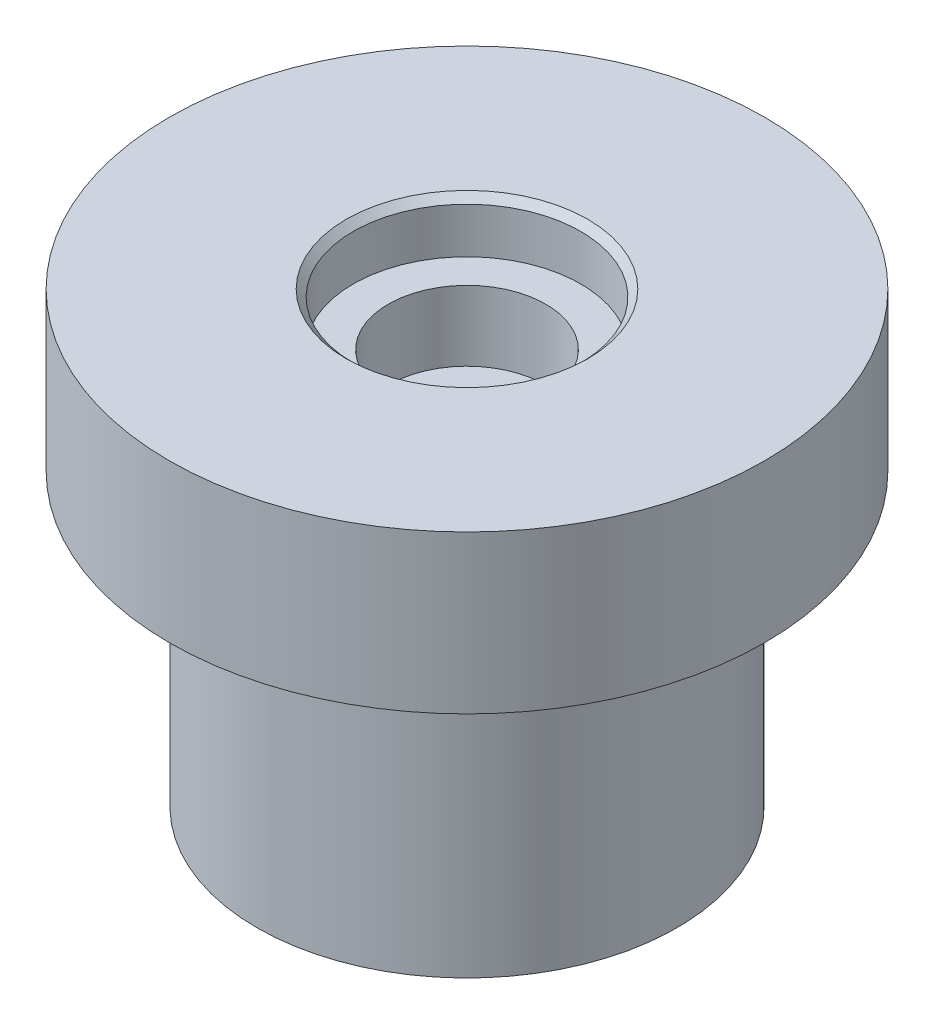
ISO-10303-21;
HEADER;
FILE_DESCRIPTION(('STEP AP214'),'2;1');
FILE_NAME('part.step','',(''),(''),'','','');
FILE_SCHEMA(('AUTOMOTIVE_DESIGN { 1 0 10303 214 1 1 1 1 }'));
ENDSEC;
DATA;
#1=APPLICATION_CONTEXT('core data for automotive mechanical design processes');
#2=APPLICATION_PROTOCOL_DEFINITION('international standard','automotive_design',2000,#1);
#3=PRODUCT_CONTEXT('',#1,'mechanical');
#4=PRODUCT('Part','Part','',(#3));
#5=PRODUCT_RELATED_PRODUCT_CATEGORY('part','',(#4));
#6=PRODUCT_DEFINITION_FORMATION('','',#4);
#7=PRODUCT_DEFINITION_CONTEXT('part definition',#1,'design');
#8=PRODUCT_DEFINITION('design','',#6,#7);
#9=PRODUCT_DEFINITION_SHAPE('','',#8);
#10=(LENGTH_UNIT() NAMED_UNIT(*) SI_UNIT(.MILLI.,.METRE.));
#11=(NAMED_UNIT(*) PLANE_ANGLE_UNIT() SI_UNIT($,.RADIAN.));
#12=(NAMED_UNIT(*) SI_UNIT($,.STERADIAN.) SOLID_ANGLE_UNIT());
#13=UNCERTAINTY_MEASURE_WITH_UNIT(LENGTH_MEASURE(1.E-05),#10,'distance_accuracy_value','');
#14=(GEOMETRIC_REPRESENTATION_CONTEXT(3) GLOBAL_UNCERTAINTY_ASSIGNED_CONTEXT((#13)) GLOBAL_UNIT_ASSIGNED_CONTEXT((#10,
#11,#12)) REPRESENTATION_CONTEXT('',''));
#15=CARTESIAN_POINT('',(0.,0.,0.));
#16=DIRECTION('',(0.,0.,1.));
#17=DIRECTION('',(1.,0.,0.));
#18=AXIS2_PLACEMENT_3D('',#15,#16,#17);
#19=CARTESIAN_POINT('',(0.,12.8,0.));
#20=DIRECTION('',(0.,1.,0.));
#21=DIRECTION('',(0.,0.,1.));
#22=AXIS2_PLACEMENT_3D('',#19,#20,#21);
#23=PLANE('',#22);
#24=CARTESIAN_POINT('',(0.,12.8,0.));
#25=DIRECTION('',(0.,1.,0.));
#26=DIRECTION('',(0.,0.,1.));
#27=AXIS2_PLACEMENT_3D('',#24,#25,#26);
#28=CIRCLE('',#27,3.45);
#29=CARTESIAN_POINT('',(0.,12.8,3.45));
#30=VERTEX_POINT('',#29);
#31=EDGE_CURVE('E11',#30,#30,#28,.F.);
#32=ORIENTED_EDGE('',*,*,#31,.T.);
#33=EDGE_LOOP('',(#32));
#34=FACE_BOUND('',#33,.T.);
#35=CARTESIAN_POINT('',(0.,12.8,0.));
#36=DIRECTION('',(0.,1.,0.));
#37=DIRECTION('',(0.,0.,1.));
#38=AXIS2_PLACEMENT_3D('',#35,#36,#37);
#39=CIRCLE('',#38,8.5);
#40=CARTESIAN_POINT('',(0.,12.8,8.5));
#41=VERTEX_POINT('',#40);
#42=EDGE_CURVE('E62',#41,#41,#39,.T.);
#43=ORIENTED_EDGE('',*,*,#42,.T.);
#44=EDGE_LOOP('',(#43));
#45=FACE_BOUND('',#44,.T.);
#46=ADVANCED_FACE('F36',(#34,#45),#23,.T.);
#47=CARTESIAN_POINT('',(0.,11.3,0.));
#48=DIRECTION('',(0.,1.,0.));
#49=DIRECTION('',(0.,0.,1.));
#50=AXIS2_PLACEMENT_3D('',#47,#48,#49);
#51=CYLINDRICAL_SURFACE('',#50,3.25);
#52=CARTESIAN_POINT('',(0.,12.6,0.));
#53=DIRECTION('',(0.,1.,0.));
#54=DIRECTION('',(0.,0.,1.));
#55=AXIS2_PLACEMENT_3D('',#52,#53,#54);
#56=CIRCLE('',#55,3.25);
#57=CARTESIAN_POINT('',(0.,12.6,3.25));
#58=VERTEX_POINT('',#57);
#59=EDGE_CURVE('E44',#58,#58,#56,.T.);
#60=ORIENTED_EDGE('',*,*,#59,.T.);
#61=EDGE_LOOP('',(#60));
#62=FACE_BOUND('',#61,.T.);
#63=CARTESIAN_POINT('',(0.,11.3,0.));
#64=DIRECTION('',(0.,1.,0.));
#65=DIRECTION('',(0.,0.,1.));
#66=AXIS2_PLACEMENT_3D('',#63,#64,#65);
#67=CIRCLE('',#66,3.25);
#68=CARTESIAN_POINT('',(0.,11.3,3.25));
#69=VERTEX_POINT('',#68);
#70=EDGE_CURVE('E53',#69,#69,#67,.T.);
#71=ORIENTED_EDGE('',*,*,#70,.F.);
#72=EDGE_LOOP('',(#71));
#73=FACE_BOUND('',#72,.T.);
#74=ADVANCED_FACE('F87',(#62,#73),#51,.F.);
#75=CARTESIAN_POINT('',(0.,11.3,0.));
#76=DIRECTION('',(0.,1.,0.));
#77=DIRECTION('',(0.,0.,1.));
#78=AXIS2_PLACEMENT_3D('',#75,#76,#77);
#79=PLANE('',#78);
#80=CARTESIAN_POINT('',(0.,11.3,0.));
#81=DIRECTION('',(0.,1.,0.));
#82=DIRECTION('',(0.,0.,1.));
#83=AXIS2_PLACEMENT_3D('',#80,#81,#82);
#84=CIRCLE('',#83,2.25);
#85=CARTESIAN_POINT('',(0.,11.3,2.25));
#86=VERTEX_POINT('',#85);
#87=EDGE_CURVE('E57',#86,#86,#84,.T.);
#88=ORIENTED_EDGE('',*,*,#87,.F.);
#89=EDGE_LOOP('',(#88));
#90=FACE_BOUND('',#89,.T.);
#91=ORIENTED_EDGE('',*,*,#70,.T.);
#92=EDGE_LOOP('',(#91));
#93=FACE_BOUND('',#92,.T.);
#94=ADVANCED_FACE('F93',(#90,#93),#79,.T.);
#95=CARTESIAN_POINT('',(0.,9.3,0.));
#96=DIRECTION('',(0.,1.,0.));
#97=DIRECTION('',(0.,0.,1.));
#98=AXIS2_PLACEMENT_3D('',#95,#96,#97);
#99=CYLINDRICAL_SURFACE('',#98,2.25);
#100=CARTESIAN_POINT('',(0.,9.3,0.));
#101=DIRECTION('',(0.,1.,0.));
#102=DIRECTION('',(0.,0.,1.));
#103=AXIS2_PLACEMENT_3D('',#100,#101,#102);
#104=CIRCLE('',#103,2.25);
#105=CARTESIAN_POINT('',(0.,9.3,2.25));
#106=VERTEX_POINT('',#105);
#107=EDGE_CURVE('E56',#106,#106,#104,.T.);
#108=ORIENTED_EDGE('',*,*,#107,.F.);
#109=EDGE_LOOP('',(#108));
#110=FACE_BOUND('',#109,.T.);
#111=ORIENTED_EDGE('',*,*,#87,.T.);
#112=EDGE_LOOP('',(#111));
#113=FACE_BOUND('',#112,.T.);
#114=ADVANCED_FACE('F103',(#110,#113),#99,.F.);
#115=CARTESIAN_POINT('',(0.,9.3,0.));
#116=DIRECTION('',(0.,1.,0.));
#117=DIRECTION('',(0.,0.,1.));
#118=AXIS2_PLACEMENT_3D('',#115,#116,#117);
#119=PLANE('',#118);
#120=ORIENTED_EDGE('',*,*,#107,.T.);
#121=EDGE_LOOP('',(#120));
#122=FACE_BOUND('',#121,.T.);
#123=ADVANCED_FACE('F107',(#122),#119,.T.);
#124=CARTESIAN_POINT('',(0.,12.6,0.));
#125=DIRECTION('',(0.,1.,0.));
#126=DIRECTION('',(0.,0.,1.));
#127=AXIS2_PLACEMENT_3D('',#124,#125,#126);
#128=CONICAL_SURFACE('',#127,3.25,0.78539816339745);
#129=ORIENTED_EDGE('',*,*,#31,.F.);
#130=EDGE_LOOP('',(#129));
#131=FACE_BOUND('',#130,.T.);
#132=ORIENTED_EDGE('',*,*,#59,.F.);
#133=EDGE_LOOP('',(#132));
#134=FACE_BOUND('',#133,.T.);
#135=ADVANCED_FACE('F38',(#131,#134),#128,.F.);
#136=CARTESIAN_POINT('',(0.,8.3,0.));
#137=DIRECTION('',(0.,1.,0.));
#138=DIRECTION('',(0.,0.,1.));
#139=AXIS2_PLACEMENT_3D('',#136,#137,#138);
#140=CYLINDRICAL_SURFACE('',#139,8.5);
#141=CARTESIAN_POINT('',(0.,8.3,0.));
#142=DIRECTION('',(0.,1.,0.));
#143=DIRECTION('',(0.,0.,1.));
#144=AXIS2_PLACEMENT_3D('',#141,#142,#143);
#145=CIRCLE('',#144,8.5);
#146=CARTESIAN_POINT('',(0.,8.3,8.5));
#147=VERTEX_POINT('',#146);
#148=EDGE_CURVE('E65',#147,#147,#145,.T.);
#149=ORIENTED_EDGE('',*,*,#148,.T.);
#150=EDGE_LOOP('',(#149));
#151=FACE_BOUND('',#150,.T.);
#152=ORIENTED_EDGE('',*,*,#42,.F.);
#153=EDGE_LOOP('',(#152));
#154=FACE_BOUND('',#153,.T.);
#155=ADVANCED_FACE('F78',(#151,#154),#140,.T.);
#156=CARTESIAN_POINT('',(0.,8.3,0.));
#157=DIRECTION('',(0.,1.,0.));
#158=DIRECTION('',(0.,0.,1.));
#159=AXIS2_PLACEMENT_3D('',#156,#157,#158);
#160=PLANE('',#159);
#161=CARTESIAN_POINT('',(0.,8.3,0.));
#162=DIRECTION('',(0.,1.,0.));
#163=DIRECTION('',(0.,0.,1.));
#164=AXIS2_PLACEMENT_3D('',#161,#162,#163);
#165=CIRCLE('',#164,6.);
#166=CARTESIAN_POINT('',(0.,8.3,6.));
#167=VERTEX_POINT('',#166);
#168=EDGE_CURVE('E40',#167,#167,#165,.F.);
#169=ORIENTED_EDGE('',*,*,#168,.F.);
#170=EDGE_LOOP('',(#169));
#171=FACE_BOUND('',#170,.T.);
#172=ORIENTED_EDGE('',*,*,#148,.F.);
#173=EDGE_LOOP('',(#172));
#174=FACE_BOUND('',#173,.T.);
#175=ADVANCED_FACE('F74',(#171,#174),#160,.F.);
#176=CARTESIAN_POINT('',(0.,0.,0.));
#177=DIRECTION('',(0.,1.,0.));
#178=DIRECTION('',(0.,0.,1.));
#179=AXIS2_PLACEMENT_3D('',#176,#177,#178);
#180=PLANE('',#179);
#181=CARTESIAN_POINT('',(0.,0.,0.));
#182=DIRECTION('',(0.,-1.,0.));
#183=DIRECTION('',(0.,0.,-1.));
#184=AXIS2_PLACEMENT_3D('',#181,#182,#183);
#185=CIRCLE('',#184,6.);
#186=CARTESIAN_POINT('',(0.,0.,-6.));
#187=VERTEX_POINT('',#186);
#188=EDGE_CURVE('E48',#187,#187,#185,.T.);
#189=ORIENTED_EDGE('',*,*,#188,.T.);
#190=EDGE_LOOP('',(#189));
#191=FACE_BOUND('',#190,.T.);
#192=ADVANCED_FACE('F77',(#191),#180,.F.);
#193=CARTESIAN_POINT('',(0.,12.8,0.));
#194=DIRECTION('',(0.,-1.,0.));
#195=DIRECTION('',(0.,0.,-1.));
#196=AXIS2_PLACEMENT_3D('',#193,#194,#195);
#197=CYLINDRICAL_SURFACE('',#196,6.);
#198=ORIENTED_EDGE('',*,*,#188,.F.);
#199=EDGE_LOOP('',(#198));
#200=FACE_BOUND('',#199,.T.);
#201=ORIENTED_EDGE('',*,*,#168,.T.);
#202=EDGE_LOOP('',(#201));
#203=FACE_BOUND('',#202,.T.);
#204=ADVANCED_FACE('F72',(#200,#203),#197,.T.);
#205=CLOSED_SHELL('',(#46,#74,#94,#114,#123,#135,#155,#175,#192,#204));
#206=MANIFOLD_SOLID_BREP('B2',#205);
#207=ADVANCED_BREP_SHAPE_REPRESENTATION('',(#18,#206),#14);
#208=SHAPE_DEFINITION_REPRESENTATION(#9,#207);
ENDSEC;
END-ISO-10303-21;
